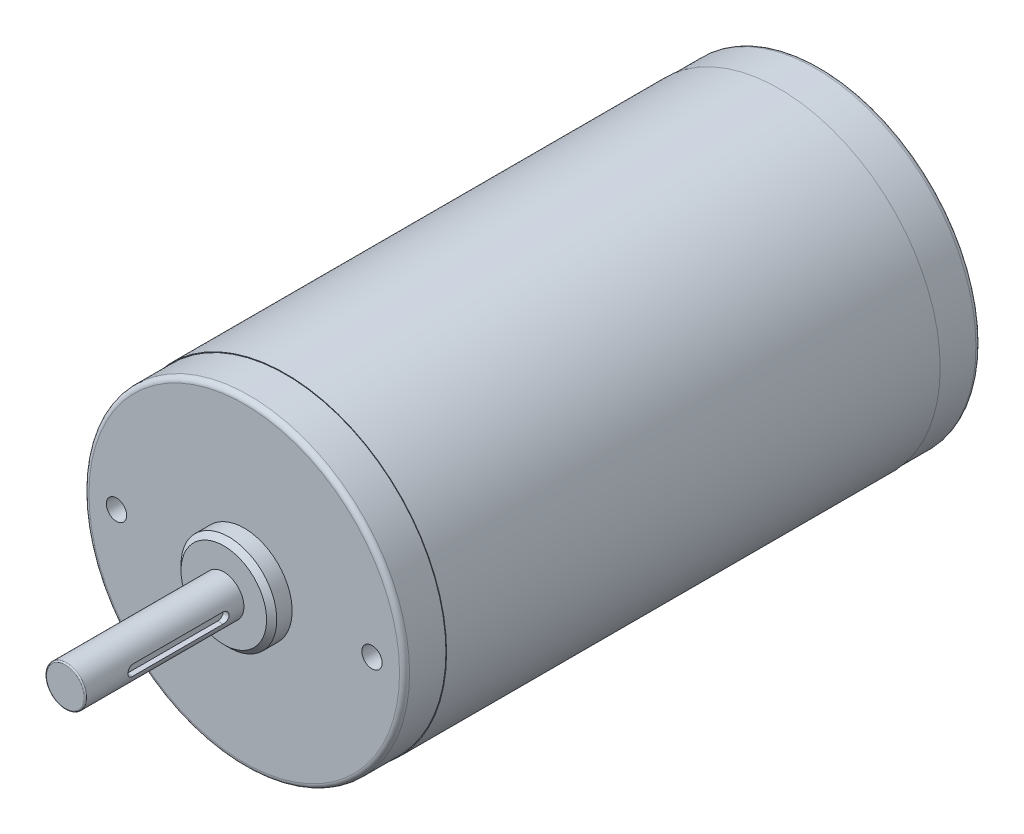
ISO-10303-21;
HEADER;
FILE_DESCRIPTION(('STEP AP214'),'2;1');
FILE_NAME('part.step','',(''),(''),'','','');
FILE_SCHEMA(('AUTOMOTIVE_DESIGN { 1 0 10303 214 1 1 1 1 }'));
ENDSEC;
DATA;
#1=APPLICATION_CONTEXT('core data for automotive mechanical design processes');
#2=APPLICATION_PROTOCOL_DEFINITION('international standard','automotive_design',2000,#1);
#3=PRODUCT_CONTEXT('',#1,'mechanical');
#4=PRODUCT('Part','Part','',(#3));
#5=PRODUCT_RELATED_PRODUCT_CATEGORY('part','',(#4));
#6=PRODUCT_DEFINITION_FORMATION('','',#4);
#7=PRODUCT_DEFINITION_CONTEXT('part definition',#1,'design');
#8=PRODUCT_DEFINITION('design','',#6,#7);
#9=PRODUCT_DEFINITION_SHAPE('','',#8);
#10=(LENGTH_UNIT() NAMED_UNIT(*) SI_UNIT(.MILLI.,.METRE.));
#11=(NAMED_UNIT(*) PLANE_ANGLE_UNIT() SI_UNIT($,.RADIAN.));
#12=(NAMED_UNIT(*) SI_UNIT($,.STERADIAN.) SOLID_ANGLE_UNIT());
#13=UNCERTAINTY_MEASURE_WITH_UNIT(LENGTH_MEASURE(1.E-05),#10,'distance_accuracy_value','');
#14=(GEOMETRIC_REPRESENTATION_CONTEXT(3) GLOBAL_UNCERTAINTY_ASSIGNED_CONTEXT((#13)) GLOBAL_UNIT_ASSIGNED_CONTEXT((#10,
#11,#12)) REPRESENTATION_CONTEXT('',''));
#15=CARTESIAN_POINT('',(0.,0.,0.));
#16=DIRECTION('',(0.,0.,1.));
#17=DIRECTION('',(1.,0.,0.));
#18=AXIS2_PLACEMENT_3D('',#15,#16,#17);
#19=CARTESIAN_POINT('',(35.56,109.2962,54.614));
#20=DIRECTION('',(0.,0.,1.));
#21=DIRECTION('',(1.,0.,0.));
#22=AXIS2_PLACEMENT_3D('',#19,#20,#21);
#23=PLANE('',#22);
#24=CARTESIAN_POINT('',(35.56,109.2962,54.614));
#25=DIRECTION('',(0.,0.,-1.));
#26=DIRECTION('',(-1.,0.,0.));
#27=AXIS2_PLACEMENT_3D('',#24,#25,#26);
#28=CIRCLE('',#27,3.74600000000008);
#29=CARTESIAN_POINT('',(31.8139999999999,109.2962,54.614));
#30=VERTEX_POINT('',#29);
#31=CARTESIAN_POINT('',(39.3060000000001,109.2962,54.614));
#32=VERTEX_POINT('',#31);
#33=EDGE_CURVE('E115',#30,#32,#28,.T.);
#34=ORIENTED_EDGE('',*,*,#33,.F.);
#35=CARTESIAN_POINT('',(35.56,109.2962,54.614));
#36=DIRECTION('',(0.,0.,-1.));
#37=DIRECTION('',(1.,0.,0.));
#38=AXIS2_PLACEMENT_3D('',#35,#36,#37);
#39=CIRCLE('',#38,3.74600000000008);
#40=EDGE_CURVE('E108',#32,#30,#39,.T.);
#41=ORIENTED_EDGE('',*,*,#40,.F.);
#42=EDGE_LOOP('',(#34,#41));
#43=FACE_BOUND('',#42,.T.);
#44=ADVANCED_FACE('F16',(#43),#23,.T.);
#45=CARTESIAN_POINT('',(38.3600000000001,109.2962,16.4984772078548));
#46=DIRECTION('',(1.,0.,0.));
#47=DIRECTION('',(0.,0.,-1.));
#48=AXIS2_PLACEMENT_3D('',#45,#46,#47);
#49=PLANE('',#48);
#50=DIRECTION('',(0.,0.,1.));
#51=VECTOR('',#50,1.);
#52=CARTESIAN_POINT('',(38.3600000000001,108.2462,16.4984772078548));
#53=LINE('',#52,#51);
#54=CARTESIAN_POINT('',(38.3600000000001,108.2462,27.1));
#55=VERTEX_POINT('',#54);
#56=CARTESIAN_POINT('',(38.3600000000001,108.2462,45.1));
#57=VERTEX_POINT('',#56);
#58=EDGE_CURVE('E103',#55,#57,#53,.T.);
#59=ORIENTED_EDGE('',*,*,#58,.F.);
#60=CARTESIAN_POINT('',(38.3600000000001,109.2962,27.1));
#61=DIRECTION('',(1.,0.,0.));
#62=DIRECTION('',(0.,0.,-1.));
#63=AXIS2_PLACEMENT_3D('',#60,#61,#62);
#64=CIRCLE('',#63,1.05);
#65=CARTESIAN_POINT('',(38.3600000000001,110.3462,27.1));
#66=VERTEX_POINT('',#65);
#67=EDGE_CURVE('E93',#55,#66,#64,.T.);
#68=ORIENTED_EDGE('',*,*,#67,.T.);
#69=DIRECTION('',(0.,0.,1.));
#70=VECTOR('',#69,1.);
#71=CARTESIAN_POINT('',(38.3600000000001,110.3462,16.4984772078548));
#72=LINE('',#71,#70);
#73=CARTESIAN_POINT('',(38.3600000000001,110.3462,45.1));
#74=VERTEX_POINT('',#73);
#75=EDGE_CURVE('E119',#66,#74,#72,.T.);
#76=ORIENTED_EDGE('',*,*,#75,.T.);
#77=CARTESIAN_POINT('',(38.3600000000001,109.2962,45.1));
#78=DIRECTION('',(-1.,0.,0.));
#79=DIRECTION('',(0.,0.,1.));
#80=AXIS2_PLACEMENT_3D('',#77,#78,#79);
#81=CIRCLE('',#80,1.05);
#82=EDGE_CURVE('E87',#74,#57,#81,.F.);
#83=ORIENTED_EDGE('',*,*,#82,.T.);
#84=EDGE_LOOP('',(#59,#68,#76,#83));
#85=FACE_BOUND('',#84,.T.);
#86=ADVANCED_FACE('F104',(#85),#49,.T.);
#87=CARTESIAN_POINT('',(38.3600000000001,108.2462,16.4984772078548));
#88=DIRECTION('',(0.,1.,0.));
#89=DIRECTION('',(0.,0.,1.));
#90=AXIS2_PLACEMENT_3D('',#87,#88,#89);
#91=PLANE('',#90);
#92=DIRECTION('',(0.,0.,-1.));
#93=VECTOR('',#92,1.);
#94=CARTESIAN_POINT('',(39.4197279696891,108.2462,54.614));
#95=LINE('',#94,#93);
#96=CARTESIAN_POINT('',(39.4197279696891,108.2462,27.1));
#97=VERTEX_POINT('',#96);
#98=CARTESIAN_POINT('',(39.4197279696891,108.2462,45.1));
#99=VERTEX_POINT('',#98);
#100=EDGE_CURVE('E112',#97,#99,#95,.F.);
#101=ORIENTED_EDGE('',*,*,#100,.F.);
#102=DIRECTION('',(1.,0.,0.));
#103=VECTOR('',#102,1.);
#104=CARTESIAN_POINT('',(38.3600000000001,108.2462,27.1));
#105=LINE('',#104,#103);
#106=EDGE_CURVE('E97',#97,#55,#105,.F.);
#107=ORIENTED_EDGE('',*,*,#106,.T.);
#108=ORIENTED_EDGE('',*,*,#58,.T.);
#109=DIRECTION('',(1.,0.,0.));
#110=VECTOR('',#109,1.);
#111=CARTESIAN_POINT('',(38.3600000000001,108.2462,45.1));
#112=LINE('',#111,#110);
#113=EDGE_CURVE('E113',#57,#99,#112,.T.);
#114=ORIENTED_EDGE('',*,*,#113,.T.);
#115=EDGE_LOOP('',(#101,#107,#108,#114));
#116=FACE_BOUND('',#115,.T.);
#117=ADVANCED_FACE('F110',(#116),#91,.T.);
#118=CARTESIAN_POINT('',(35.56,109.2962,54.36));
#119=DIRECTION('',(0.,0.,1.));
#120=DIRECTION('',(1.,0.,0.));
#121=AXIS2_PLACEMENT_3D('',#118,#119,#120);
#122=TOROIDAL_SURFACE('',#121,3.74600000000008,0.254);
#123=ORIENTED_EDGE('',*,*,#40,.T.);
#124=ORIENTED_EDGE('',*,*,#33,.T.);
#125=EDGE_LOOP('',(#123,#124));
#126=FACE_BOUND('',#125,.T.);
#127=CARTESIAN_POINT('',(35.56,109.2962,54.36));
#128=DIRECTION('',(0.,0.,-1.));
#129=DIRECTION('',(-1.,0.,0.));
#130=AXIS2_PLACEMENT_3D('',#127,#128,#129);
#131=CIRCLE('',#130,4.00000000000007);
#132=CARTESIAN_POINT('',(31.5599999999999,109.2962,54.36));
#133=VERTEX_POINT('',#132);
#134=EDGE_CURVE('E164',#133,#133,#131,.T.);
#135=ORIENTED_EDGE('',*,*,#134,.F.);
#136=EDGE_LOOP('',(#135));
#137=FACE_BOUND('',#136,.T.);
#138=ADVANCED_FACE('F146',(#126,#137),#122,.T.);
#139=CARTESIAN_POINT('',(38.3600000000001,109.2962,45.1));
#140=DIRECTION('',(-1.,0.,0.));
#141=DIRECTION('',(0.,0.,1.));
#142=AXIS2_PLACEMENT_3D('',#139,#140,#141);
#143=CYLINDRICAL_SURFACE('',#142,1.05);
#144=DIRECTION('',(1.,0.,0.));
#145=VECTOR('',#144,1.);
#146=CARTESIAN_POINT('',(38.3600000000001,110.3462,45.1));
#147=LINE('',#146,#145);
#148=CARTESIAN_POINT('',(39.4197279696891,110.3462,45.1));
#149=VERTEX_POINT('',#148);
#150=EDGE_CURVE('E101',#74,#149,#147,.T.);
#151=ORIENTED_EDGE('',*,*,#150,.T.);
#152=CARTESIAN_POINT('',(39.4197279696891,108.2462,45.1));
#153=CARTESIAN_POINT('',(39.4197258950768,108.24619958975,45.1289948990377));
#154=CARTESIAN_POINT('',(39.4200551064328,108.247401772744,45.1579753771942));
#155=CARTESIAN_POINT('',(39.4213547123988,108.252193790165,45.2157185717611));
#156=CARTESIAN_POINT('',(39.4223249908093,108.255783191888,45.2444813266804));
#157=CARTESIAN_POINT('',(39.4261578920524,108.270078067236,45.3300048839447));
#158=CARTESIAN_POINT('',(39.4299428342912,108.284310457697,45.3861763507014));
#159=CARTESIAN_POINT('',(39.4395286889104,108.321713164946,45.4952257963179));
#160=CARTESIAN_POINT('',(39.445329326456,108.344882263286,45.5481042230163));
#161=CARTESIAN_POINT('',(39.4582892232805,108.399469503916,45.6492511443793));
#162=CARTESIAN_POINT('',(39.4654488628844,108.430889956344,45.6975183428654));
#163=CARTESIAN_POINT('',(39.4805119710478,108.501890363002,45.7892077701155));
#164=CARTESIAN_POINT('',(39.4884281885094,108.541632256913,45.8325024671448));
#165=CARTESIAN_POINT('',(39.5040047400555,108.627813145963,45.9119068745175));
#166=CARTESIAN_POINT('',(39.5116649818293,108.67425452566,45.9480140156475));
#167=CARTESIAN_POINT('',(39.526010604883,108.773412379805,46.0125503896214));
#168=CARTESIAN_POINT('',(39.5326785635433,108.826216831296,46.040848518688));
#169=CARTESIAN_POINT('',(39.5441298010583,108.936002054238,46.0880888400132));
#170=CARTESIAN_POINT('',(39.5489153447307,108.992977708579,46.1070422822868));
#171=CARTESIAN_POINT('',(39.5549473168842,109.091228422711,46.1306241727345));
#172=CARTESIAN_POINT('',(39.5568321627736,109.13185376544,46.1378772746766));
#173=CARTESIAN_POINT('',(39.5593590428507,109.213713896391,46.147566034752));
#174=CARTESIAN_POINT('',(39.560001100914,109.254948672889,46.1500017854335));
#175=CARTESIAN_POINT('',(39.5599984549201,109.354094261643,46.1499974942296));
#176=CARTESIAN_POINT('',(39.5587300938834,109.412021122661,46.1451938276971));
#177=CARTESIAN_POINT('',(39.5537908073877,109.526225171743,46.1261319193829));
#178=CARTESIAN_POINT('',(39.5501176251492,109.582500758305,46.1118647965529));
#179=CARTESIAN_POINT('',(39.5407752151886,109.691711041936,46.0743710095572));
#180=CARTESIAN_POINT('',(39.5351088856793,109.744650458997,46.051157349786));
#181=CARTESIAN_POINT('',(39.5223803452478,109.845880148194,45.9964722913931));
#182=CARTESIAN_POINT('',(39.5153181479083,109.894170465564,45.9650009731229));
#183=CARTESIAN_POINT('',(39.5003832391547,109.985824414736,45.8939447079381));
#184=CARTESIAN_POINT('',(39.4924970081334,110.029068444468,45.8542083308329));
#185=CARTESIAN_POINT('',(39.4768899553604,110.108363690847,45.768070017791));
#186=CARTESIAN_POINT('',(39.4691691622905,110.144413669136,45.7216669366335));
#187=CARTESIAN_POINT('',(39.4546281048764,110.208880604601,45.6225587145474));
#188=CARTESIAN_POINT('',(39.447825217303,110.237158627992,45.5697605148942));
#189=CARTESIAN_POINT('',(39.4360941322255,110.284374941225,45.4599645484902));
#190=CARTESIAN_POINT('',(39.4311644713835,110.303320524877,45.4029701015121));
#191=CARTESIAN_POINT('',(39.424947536189,110.326869937927,45.3047298343336));
#192=CARTESIAN_POINT('',(39.4230031721686,110.334106552333,45.2641375466187));
#193=CARTESIAN_POINT('',(39.4203876966156,110.343775049367,45.1823710409093));
#194=CARTESIAN_POINT('',(39.419715789786,110.346209933161,45.141197202614));
#195=CARTESIAN_POINT('',(39.4197279696891,110.3462,45.1));
#196=B_SPLINE_CURVE_WITH_KNOTS('',3,(#152,#153,#154,#155,#156,#157,#158,#159,#160,#161,#162,
#163,#164,#165,#166,#167,#168,#169,#170,#171,#172,#173,#174,#175,#176,#177,#178,#179,#180,#181,
#182,#183,#184,#185,#186,#187,#188,#189,#190,#191,#192,#193,#194,#195),.UNSPECIFIED.,.F.,.F.,(4,
2,2,2,2,2,2,2,2,2,2,2,2,2,2,2,2,2,2,2,2,4),(0.,0.0869295778834422,0.17384340328612,
0.347151826879625,0.520436629596116,0.69376999881019,0.870856390838584,1.04800596970821,
1.22797015523126,1.40771715061754,1.53136439682193,1.65500926755904,1.82853892099362,
2.0022316554156,2.17567286221397,2.34911238140169,2.52606492372393,2.70304789975981,
2.88301467869373,3.0628405797152,3.18638852057382,3.3098592173462),.UNSPECIFIED.);
#197=EDGE_CURVE('E167',#99,#149,#196,.T.);
#198=ORIENTED_EDGE('',*,*,#197,.F.);
#199=ORIENTED_EDGE('',*,*,#113,.F.);
#200=ORIENTED_EDGE('',*,*,#82,.F.);
#201=EDGE_LOOP('',(#151,#198,#199,#200));
#202=FACE_BOUND('',#201,.T.);
#203=ADVANCED_FACE('F156',(#202),#143,.F.);
#204=CARTESIAN_POINT('',(38.3600000000001,110.3462,16.4984772078548));
#205=DIRECTION('',(0.,1.,0.));
#206=DIRECTION('',(0.,0.,1.));
#207=AXIS2_PLACEMENT_3D('',#204,#205,#206);
#208=PLANE('',#207);
#209=ORIENTED_EDGE('',*,*,#150,.F.);
#210=ORIENTED_EDGE('',*,*,#75,.F.);
#211=DIRECTION('',(1.,0.,0.));
#212=VECTOR('',#211,1.);
#213=CARTESIAN_POINT('',(38.3600000000001,110.3462,27.1));
#214=LINE('',#213,#212);
#215=CARTESIAN_POINT('',(39.4197279696891,110.3462,27.1));
#216=VERTEX_POINT('',#215);
#217=EDGE_CURVE('E99',#66,#216,#214,.T.);
#218=ORIENTED_EDGE('',*,*,#217,.T.);
#219=DIRECTION('',(0.,0.,-1.));
#220=VECTOR('',#219,1.);
#221=CARTESIAN_POINT('',(39.4197279696891,110.3462,54.614));
#222=LINE('',#221,#220);
#223=EDGE_CURVE('E169',#149,#216,#222,.T.);
#224=ORIENTED_EDGE('',*,*,#223,.F.);
#225=EDGE_LOOP('',(#209,#210,#218,#224));
#226=FACE_BOUND('',#225,.T.);
#227=ADVANCED_FACE('F417',(#226),#208,.F.);
#228=CARTESIAN_POINT('',(38.3600000000001,109.2962,27.1));
#229=DIRECTION('',(1.,0.,0.));
#230=DIRECTION('',(0.,0.,-1.));
#231=AXIS2_PLACEMENT_3D('',#228,#229,#230);
#232=CYLINDRICAL_SURFACE('',#231,1.05);
#233=ORIENTED_EDGE('',*,*,#67,.F.);
#234=ORIENTED_EDGE('',*,*,#106,.F.);
#235=CARTESIAN_POINT('',(39.4197279696891,110.3462,27.1));
#236=CARTESIAN_POINT('',(39.4197258950768,110.34620041025,27.0710051009623));
#237=CARTESIAN_POINT('',(39.4200551064329,110.344998227256,27.0420246228058));
#238=CARTESIAN_POINT('',(39.4213547123988,110.340206209835,26.9842814282389));
#239=CARTESIAN_POINT('',(39.4223249908093,110.336616808112,26.9555186733196));
#240=CARTESIAN_POINT('',(39.4261578920524,110.322321932764,26.8699951160553));
#241=CARTESIAN_POINT('',(39.4299428342912,110.308089542303,26.8138236492985));
#242=CARTESIAN_POINT('',(39.4395286889104,110.270686835054,26.7047742036821));
#243=CARTESIAN_POINT('',(39.445329326456,110.247517736714,26.6518957769836));
#244=CARTESIAN_POINT('',(39.4582892232805,110.192930496084,26.5507488556207));
#245=CARTESIAN_POINT('',(39.4654488628844,110.161510043656,26.5024816571346));
#246=CARTESIAN_POINT('',(39.4805119710478,110.090509636998,26.4107922298844));
#247=CARTESIAN_POINT('',(39.4884281885094,110.050767743087,26.3674975328551));
#248=CARTESIAN_POINT('',(39.5040047400555,109.964586854037,26.2880931254825));
#249=CARTESIAN_POINT('',(39.5116649818293,109.91814547434,26.2519859843525));
#250=CARTESIAN_POINT('',(39.526010604883,109.818987620195,26.1874496103786));
#251=CARTESIAN_POINT('',(39.5326785635433,109.766183168704,26.159151481312));
#252=CARTESIAN_POINT('',(39.5441298010583,109.656397945762,26.1119111599868));
#253=CARTESIAN_POINT('',(39.5489153447307,109.599422291421,26.0929577177131));
#254=CARTESIAN_POINT('',(39.5549473168842,109.501171577289,26.0693758272655));
#255=CARTESIAN_POINT('',(39.5568321627736,109.46054623456,26.0621227253234));
#256=CARTESIAN_POINT('',(39.5593590428507,109.378686103609,26.052433965248));
#257=CARTESIAN_POINT('',(39.560001100914,109.337451327111,26.0499982145665));
#258=CARTESIAN_POINT('',(39.5599984549201,109.238305738357,26.0500025057704));
#259=CARTESIAN_POINT('',(39.5587300938834,109.18037887734,26.0548061723029));
#260=CARTESIAN_POINT('',(39.5537908073877,109.066174828257,26.0738680806171));
#261=CARTESIAN_POINT('',(39.5501176251492,109.009899241695,26.0881352034471));
#262=CARTESIAN_POINT('',(39.5407752151886,108.900688958064,26.1256289904428));
#263=CARTESIAN_POINT('',(39.5351088856793,108.847749541003,26.148842650214));
#264=CARTESIAN_POINT('',(39.5223803452478,108.746519851806,26.2035277086069));
#265=CARTESIAN_POINT('',(39.5153181479083,108.698229534436,26.2349990268771));
#266=CARTESIAN_POINT('',(39.5003832391547,108.606575585264,26.3060552920619));
#267=CARTESIAN_POINT('',(39.4924970081334,108.563331555532,26.3457916691671));
#268=CARTESIAN_POINT('',(39.4768899553604,108.484036309153,26.431929982209));
#269=CARTESIAN_POINT('',(39.4691691622905,108.447986330864,26.4783330633665));
#270=CARTESIAN_POINT('',(39.4546281048764,108.383519395399,26.5774412854526));
#271=CARTESIAN_POINT('',(39.447825217303,108.355241372008,26.6302394851058));
#272=CARTESIAN_POINT('',(39.4360941322255,108.308025058775,26.7400354515098));
#273=CARTESIAN_POINT('',(39.4311644713835,108.289079475123,26.7970298984879));
#274=CARTESIAN_POINT('',(39.424947536189,108.265530062073,26.8952701656664));
#275=CARTESIAN_POINT('',(39.4230031721686,108.258293447667,26.9358624533813));
#276=CARTESIAN_POINT('',(39.4203876966156,108.248624950633,27.0176289590907));
#277=CARTESIAN_POINT('',(39.419715789786,108.246190066839,27.058802797386));
#278=CARTESIAN_POINT('',(39.4197279696891,108.2462,27.1));
#279=B_SPLINE_CURVE_WITH_KNOTS('',3,(#235,#236,#237,#238,#239,#240,#241,#242,#243,#244,#245,
#246,#247,#248,#249,#250,#251,#252,#253,#254,#255,#256,#257,#258,#259,#260,#261,#262,#263,#264,
#265,#266,#267,#268,#269,#270,#271,#272,#273,#274,#275,#276,#277,#278),.UNSPECIFIED.,.F.,.F.,(4,
2,2,2,2,2,2,2,2,2,2,2,2,2,2,2,2,2,2,2,2,4),(0.,0.0869295778834455,0.173843403286115,
0.347151826879623,0.520436629596136,0.693769998810197,0.870856390838592,1.0480059697082,
1.22797015523124,1.40771715061754,1.53136439682191,1.65500926755904,1.82853892099358,
2.00223165541559,2.17567286221396,2.34911238140168,2.52606492372391,2.7030478997598,
2.88301467869372,3.06284057971519,3.18638852057381,3.30985921734618),.UNSPECIFIED.);
#280=EDGE_CURVE('E172',#216,#97,#279,.T.);
#281=ORIENTED_EDGE('',*,*,#280,.F.);
#282=ORIENTED_EDGE('',*,*,#217,.F.);
#283=EDGE_LOOP('',(#233,#234,#281,#282));
#284=FACE_BOUND('',#283,.T.);
#285=ADVANCED_FACE('F94',(#284),#232,.F.);
#286=CARTESIAN_POINT('',(35.56,109.2962,54.614));
#287=DIRECTION('',(0.,0.,-1.));
#288=DIRECTION('',(-1.,0.,0.));
#289=AXIS2_PLACEMENT_3D('',#286,#287,#288);
#290=CYLINDRICAL_SURFACE('',#289,4.00000000000007);
#291=ORIENTED_EDGE('',*,*,#100,.T.);
#292=ORIENTED_EDGE('',*,*,#197,.T.);
#293=ORIENTED_EDGE('',*,*,#223,.T.);
#294=ORIENTED_EDGE('',*,*,#280,.T.);
#295=EDGE_LOOP('',(#291,#292,#293,#294));
#296=FACE_BOUND('',#295,.T.);
#297=CARTESIAN_POINT('',(35.56,109.2962,23.114));
#298=DIRECTION('',(0.,0.,-1.));
#299=DIRECTION('',(-1.,0.,0.));
#300=AXIS2_PLACEMENT_3D('',#297,#298,#299);
#301=CIRCLE('',#300,4.00000000000007);
#302=CARTESIAN_POINT('',(31.5599999999999,109.2962,23.114));
#303=VERTEX_POINT('',#302);
#304=EDGE_CURVE('E410',#303,#303,#301,.T.);
#305=ORIENTED_EDGE('',*,*,#304,.F.);
#306=EDGE_LOOP('',(#305));
#307=FACE_BOUND('',#306,.T.);
#308=ORIENTED_EDGE('',*,*,#134,.T.);
#309=EDGE_LOOP('',(#308));
#310=FACE_BOUND('',#309,.T.);
#311=ADVANCED_FACE('F255',(#296,#307,#310),#290,.T.);
#312=CARTESIAN_POINT('',(35.56,109.2962,23.114));
#313=DIRECTION('',(0.,0.,1.));
#314=DIRECTION('',(1.,0.,0.));
#315=AXIS2_PLACEMENT_3D('',#312,#313,#314);
#316=PLANE('',#315);
#317=ORIENTED_EDGE('',*,*,#304,.T.);
#318=EDGE_LOOP('',(#317));
#319=FACE_BOUND('',#318,.T.);
#320=CARTESIAN_POINT('',(35.56,109.2962,23.114));
#321=DIRECTION('',(0.,0.,-1.));
#322=DIRECTION('',(-1.,0.,0.));
#323=AXIS2_PLACEMENT_3D('',#320,#321,#322);
#324=CIRCLE('',#323,8.50900000182337);
#325=CARTESIAN_POINT('',(27.0509999981766,109.2962,23.114));
#326=VERTEX_POINT('',#325);
#327=EDGE_CURVE('E408',#326,#326,#324,.T.);
#328=ORIENTED_EDGE('',*,*,#327,.F.);
#329=EDGE_LOOP('',(#328));
#330=FACE_BOUND('',#329,.T.);
#331=ADVANCED_FACE('F251',(#319,#330),#316,.T.);
#332=CARTESIAN_POINT('',(48.8853596371201,127.903290682857,-97.8026999980236));
#333=DIRECTION('',(0.,0.,-1.));
#334=DIRECTION('',(-1.,0.,0.));
#335=AXIS2_PLACEMENT_3D('',#332,#333,#334);
#336=PLANE('',#335);
#337=CARTESIAN_POINT('',(46.76735963712,127.903290682857,-97.8026999979988));
#338=DIRECTION('',(0.,0.,1.));
#339=DIRECTION('',(0.,-1.,0.));
#340=AXIS2_PLACEMENT_3D('',#337,#338,#339);
#341=CIRCLE('',#340,2.11800000003411);
#342=CARTESIAN_POINT('',(46.76735963712,125.785290682823,-97.8026999979988));
#343=VERTEX_POINT('',#342);
#344=EDGE_CURVE('E405',#343,#343,#341,.T.);
#345=ORIENTED_EDGE('',*,*,#344,.F.);
#346=EDGE_LOOP('',(#345));
#347=FACE_BOUND('',#346,.T.);
#348=ADVANCED_FACE('F247',(#347),#336,.T.);
#349=CARTESIAN_POINT('',(56.2850906808811,120.503559639096,-97.8026999980238));
#350=DIRECTION('',(0.,0.,-1.));
#351=DIRECTION('',(-1.,0.,0.));
#352=AXIS2_PLACEMENT_3D('',#349,#350,#351);
#353=PLANE('',#352);
#354=CARTESIAN_POINT('',(54.1670906808811,120.503559639096,-97.8026999980557));
#355=DIRECTION('',(0.,0.,1.));
#356=DIRECTION('',(0.,-1.,0.));
#357=AXIS2_PLACEMENT_3D('',#354,#355,#356);
#358=CIRCLE('',#357,2.11799999994966);
#359=CARTESIAN_POINT('',(54.1670906808811,118.385559639146,-97.8026999980557));
#360=VERTEX_POINT('',#359);
#361=EDGE_CURVE('E401',#360,#360,#358,.T.);
#362=ORIENTED_EDGE('',*,*,#361,.F.);
#363=EDGE_LOOP('',(#362));
#364=FACE_BOUND('',#363,.T.);
#365=ADVANCED_FACE('F235',(#364),#353,.T.);
#366=CARTESIAN_POINT('',(35.56,109.2962,-100.317299999998));
#367=DIRECTION('',(0.,0.,-1.));
#368=DIRECTION('',(-1.,0.,0.));
#369=AXIS2_PLACEMENT_3D('',#366,#367,#368);
#370=PLANE('',#369);
#371=CARTESIAN_POINT('',(35.56,109.2962,-100.317299999998));
#372=DIRECTION('',(0.,0.,1.));
#373=DIRECTION('',(1.,0.,0.));
#374=AXIS2_PLACEMENT_3D('',#371,#372,#373);
#375=CIRCLE('',#374,14.0368000000003);
#376=CARTESIAN_POINT('',(49.5968000000003,109.2962,-100.317299999998));
#377=VERTEX_POINT('',#376);
#378=CARTESIAN_POINT('',(21.5231999999997,109.2962,-100.317299999998));
#379=VERTEX_POINT('',#378);
#380=EDGE_CURVE('E216',#377,#379,#375,.T.);
#381=ORIENTED_EDGE('',*,*,#380,.F.);
#382=CARTESIAN_POINT('',(35.56,109.2962,-100.317299999998));
#383=DIRECTION('',(0.,0.,1.));
#384=DIRECTION('',(-1.,0.,0.));
#385=AXIS2_PLACEMENT_3D('',#382,#383,#384);
#386=CIRCLE('',#385,14.0368000000003);
#387=EDGE_CURVE('E404',#379,#377,#386,.T.);
#388=ORIENTED_EDGE('',*,*,#387,.F.);
#389=EDGE_LOOP('',(#381,#388));
#390=FACE_BOUND('',#389,.T.);
#391=ADVANCED_FACE('F224',(#390),#370,.T.);
#392=CARTESIAN_POINT('',(10.1599999999994,109.2962,5.43560000011212));
#393=DIRECTION('',(0.,0.,1.));
#394=DIRECTION('',(1.,0.,0.));
#395=AXIS2_PLACEMENT_3D('',#392,#393,#394);
#396=CONICAL_SURFACE('',#395,2.01930000012817,1.02974425747654);
#397=CARTESIAN_POINT('',(10.1600000000133,109.2962,4.22228214875986));
#398=VERTEX_POINT('',#397);
#399=VERTEX_LOOP('',#398);
#400=FACE_BOUND('',#399,.T.);
#401=CARTESIAN_POINT('',(10.1599999999994,109.2962,5.4356000000007));
#402=DIRECTION('',(0.,0.,1.));
#403=DIRECTION('',(1.,0.,0.));
#404=AXIS2_PLACEMENT_3D('',#401,#402,#403);
#405=CIRCLE('',#404,2.01930000000003);
#406=CARTESIAN_POINT('',(12.1792999999994,109.2962,5.4356000000007));
#407=VERTEX_POINT('',#406);
#408=EDGE_CURVE('E213',#407,#407,#405,.T.);
#409=ORIENTED_EDGE('',*,*,#408,.T.);
#410=EDGE_LOOP('',(#409));
#411=FACE_BOUND('',#410,.T.);
#412=ADVANCED_FACE('F234',(#400,#411),#396,.F.);
#413=CARTESIAN_POINT('',(60.96,109.2962,5.43559999994159));
#414=DIRECTION('',(0.,0.,1.));
#415=DIRECTION('',(1.,0.,0.));
#416=AXIS2_PLACEMENT_3D('',#413,#414,#415);
#417=CONICAL_SURFACE('',#416,2.01929999988128,1.02974425744088);
#418=CARTESIAN_POINT('',(60.9599999998807,109.2962,4.22228214875986));
#419=VERTEX_POINT('',#418);
#420=VERTEX_LOOP('',#419);
#421=FACE_BOUND('',#420,.T.);
#422=CARTESIAN_POINT('',(60.96,109.2962,5.43560000000074));
#423=DIRECTION('',(0.,0.,1.));
#424=DIRECTION('',(1.,0.,0.));
#425=AXIS2_PLACEMENT_3D('',#422,#423,#424);
#426=CIRCLE('',#425,2.01930000000003);
#427=CARTESIAN_POINT('',(62.9793,109.2962,5.43560000000074));
#428=VERTEX_POINT('',#427);
#429=EDGE_CURVE('E210',#428,#428,#426,.T.);
#430=ORIENTED_EDGE('',*,*,#429,.T.);
#431=EDGE_LOOP('',(#430));
#432=FACE_BOUND('',#431,.T.);
#433=ADVANCED_FACE('F574',(#421,#432),#417,.F.);
#434=CARTESIAN_POINT('',(35.56,109.2962,22.0979999999996));
#435=DIRECTION('',(0.,0.,-1.));
#436=DIRECTION('',(-1.,0.,0.));
#437=AXIS2_PLACEMENT_3D('',#434,#435,#436);
#438=CONICAL_SURFACE('',#437,9.52500000000019,0.785398162500005);
#439=CARTESIAN_POINT('',(35.56,109.2962,22.0979999999996));
#440=DIRECTION('',(0.,0.,-1.));
#441=DIRECTION('',(-1.,0.,0.));
#442=AXIS2_PLACEMENT_3D('',#439,#440,#441);
#443=CIRCLE('',#442,9.52500000000019);
#444=CARTESIAN_POINT('',(26.0349999999998,109.2962,22.0979999999996));
#445=VERTEX_POINT('',#444);
#446=EDGE_CURVE('E207',#445,#445,#443,.T.);
#447=ORIENTED_EDGE('',*,*,#446,.F.);
#448=EDGE_LOOP('',(#447));
#449=FACE_BOUND('',#448,.T.);
#450=ORIENTED_EDGE('',*,*,#327,.T.);
#451=EDGE_LOOP('',(#450));
#452=FACE_BOUND('',#451,.T.);
#453=ADVANCED_FACE('F567',(#449,#452),#438,.T.);
#454=CARTESIAN_POINT('',(46.76735963712,127.903290682857,-95.6026999959931));
#455=DIRECTION('',(0.,0.,1.));
#456=DIRECTION('',(0.,-1.,0.));
#457=AXIS2_PLACEMENT_3D('',#454,#455,#456);
#458=CONICAL_SURFACE('',#457,4.31800000198298,0.785398163384529);
#459=CARTESIAN_POINT('',(46.76735963712,127.903290682857,-95.6026999960491));
#460=DIRECTION('',(0.,0.,1.));
#461=DIRECTION('',(1.,0.,0.));
#462=AXIS2_PLACEMENT_3D('',#459,#460,#461);
#463=CIRCLE('',#462,4.3180000019745);
#464=CARTESIAN_POINT('',(51.0853596390945,127.903290682857,-95.6026999960491));
#465=VERTEX_POINT('',#464);
#466=EDGE_CURVE('E204',#465,#465,#463,.T.);
#467=ORIENTED_EDGE('',*,*,#466,.F.);
#468=EDGE_LOOP('',(#467));
#469=FACE_BOUND('',#468,.T.);
#470=ORIENTED_EDGE('',*,*,#344,.T.);
#471=EDGE_LOOP('',(#470));
#472=FACE_BOUND('',#471,.T.);
#473=ADVANCED_FACE('F573',(#469,#472),#458,.T.);
#474=CARTESIAN_POINT('',(54.1670906808811,120.503559639096,-95.6026999961637));
#475=DIRECTION('',(0.,0.,1.));
#476=DIRECTION('',(0.,-1.,0.));
#477=AXIS2_PLACEMENT_3D('',#474,#475,#476);
#478=CONICAL_SURFACE('',#477,4.31800000184168,0.785398163397448);
#479=CARTESIAN_POINT('',(54.1670906808811,120.503559639096,-95.6026999960494));
#480=DIRECTION('',(0.,0.,1.));
#481=DIRECTION('',(1.,0.,0.));
#482=AXIS2_PLACEMENT_3D('',#479,#480,#481);
#483=CIRCLE('',#482,4.31800000197446);
#484=CARTESIAN_POINT('',(58.4850906828556,120.503559639096,-95.6026999960494));
#485=VERTEX_POINT('',#484);
#486=EDGE_CURVE('E201',#485,#485,#483,.T.);
#487=ORIENTED_EDGE('',*,*,#486,.F.);
#488=EDGE_LOOP('',(#487));
#489=FACE_BOUND('',#488,.T.);
#490=ORIENTED_EDGE('',*,*,#361,.T.);
#491=EDGE_LOOP('',(#490));
#492=FACE_BOUND('',#491,.T.);
#493=ADVANCED_FACE('F191',(#489,#492),#478,.T.);
#494=CARTESIAN_POINT('',(35.56,109.2962,-99.317299999998));
#495=DIRECTION('',(0.,0.,-1.));
#496=DIRECTION('',(-1.,0.,0.));
#497=AXIS2_PLACEMENT_3D('',#494,#495,#496);
#498=TOROIDAL_SURFACE('',#497,14.0368000000003,1.);
#499=ORIENTED_EDGE('',*,*,#387,.T.);
#500=ORIENTED_EDGE('',*,*,#380,.T.);
#501=EDGE_LOOP('',(#499,#500));
#502=FACE_BOUND('',#501,.T.);
#503=CARTESIAN_POINT('',(35.56,109.2962,-99.317299999998));
#504=DIRECTION('',(0.,0.,1.));
#505=DIRECTION('',(1.,0.,0.));
#506=AXIS2_PLACEMENT_3D('',#503,#504,#505);
#507=CIRCLE('',#506,15.0368000000003);
#508=CARTESIAN_POINT('',(50.5968000000003,109.2962,-99.317299999998));
#509=VERTEX_POINT('',#508);
#510=EDGE_CURVE('E199',#509,#509,#507,.T.);
#511=ORIENTED_EDGE('',*,*,#510,.F.);
#512=EDGE_LOOP('',(#511));
#513=FACE_BOUND('',#512,.T.);
#514=ADVANCED_FACE('F179',(#502,#513),#498,.T.);
#515=CARTESIAN_POINT('',(10.1599999999994,109.2962,19.05));
#516=DIRECTION('',(0.,0.,1.));
#517=DIRECTION('',(1.,0.,0.));
#518=AXIS2_PLACEMENT_3D('',#515,#516,#517);
#519=CYLINDRICAL_SURFACE('',#518,2.01930000000003);
#520=CARTESIAN_POINT('',(10.1599999999994,109.2962,19.05));
#521=DIRECTION('',(0.,0.,1.));
#522=DIRECTION('',(1.,0.,0.));
#523=AXIS2_PLACEMENT_3D('',#520,#521,#522);
#524=CIRCLE('',#523,2.01930000000003);
#525=CARTESIAN_POINT('',(12.1792999999994,109.2962,19.05));
#526=VERTEX_POINT('',#525);
#527=EDGE_CURVE('E398',#526,#526,#524,.F.);
#528=ORIENTED_EDGE('',*,*,#527,.F.);
#529=EDGE_LOOP('',(#528));
#530=FACE_BOUND('',#529,.T.);
#531=ORIENTED_EDGE('',*,*,#408,.F.);
#532=EDGE_LOOP('',(#531));
#533=FACE_BOUND('',#532,.T.);
#534=ADVANCED_FACE('F190',(#530,#533),#519,.F.);
#535=CARTESIAN_POINT('',(60.96,109.2962,19.05));
#536=DIRECTION('',(0.,0.,1.));
#537=DIRECTION('',(1.,0.,0.));
#538=AXIS2_PLACEMENT_3D('',#535,#536,#537);
#539=CYLINDRICAL_SURFACE('',#538,2.01930000000003);
#540=CARTESIAN_POINT('',(60.96,109.2962,19.05));
#541=DIRECTION('',(0.,0.,1.));
#542=DIRECTION('',(1.,0.,0.));
#543=AXIS2_PLACEMENT_3D('',#540,#541,#542);
#544=CIRCLE('',#543,2.01930000000003);
#545=CARTESIAN_POINT('',(62.9793,109.2962,19.05));
#546=VERTEX_POINT('',#545);
#547=EDGE_CURVE('E395',#546,#546,#544,.F.);
#548=ORIENTED_EDGE('',*,*,#547,.F.);
#549=EDGE_LOOP('',(#548));
#550=FACE_BOUND('',#549,.T.);
#551=ORIENTED_EDGE('',*,*,#429,.F.);
#552=EDGE_LOOP('',(#551));
#553=FACE_BOUND('',#552,.T.);
#554=ADVANCED_FACE('F596',(#550,#553),#539,.F.);
#555=CARTESIAN_POINT('',(35.56,109.2962,23.114));
#556=DIRECTION('',(0.,0.,-1.));
#557=DIRECTION('',(-1.,0.,0.));
#558=AXIS2_PLACEMENT_3D('',#555,#556,#557);
#559=CYLINDRICAL_SURFACE('',#558,9.52500000000019);
#560=CARTESIAN_POINT('',(35.56,109.2962,19.05));
#561=DIRECTION('',(0.,0.,-1.));
#562=DIRECTION('',(-1.,0.,0.));
#563=AXIS2_PLACEMENT_3D('',#560,#561,#562);
#564=CIRCLE('',#563,9.52500000000019);
#565=CARTESIAN_POINT('',(26.0349999999998,109.2962,19.05));
#566=VERTEX_POINT('',#565);
#567=EDGE_CURVE('E392',#566,#566,#564,.T.);
#568=ORIENTED_EDGE('',*,*,#567,.F.);
#569=EDGE_LOOP('',(#568));
#570=FACE_BOUND('',#569,.T.);
#571=ORIENTED_EDGE('',*,*,#446,.T.);
#572=EDGE_LOOP('',(#571));
#573=FACE_BOUND('',#572,.T.);
#574=ADVANCED_FACE('F606',(#570,#573),#559,.T.);
#575=CARTESIAN_POINT('',(46.76735963712,127.903290682857,-97.8026999980236));
#576=DIRECTION('',(0.,0.,1.));
#577=DIRECTION('',(1.,0.,0.));
#578=AXIS2_PLACEMENT_3D('',#575,#576,#577);
#579=CYLINDRICAL_SURFACE('',#578,4.3180000019745);
#580=CARTESIAN_POINT('',(46.76735963712,127.903290682857,-95.554799999998));
#581=DIRECTION('',(0.,0.,1.));
#582=DIRECTION('',(1.,0.,0.));
#583=AXIS2_PLACEMENT_3D('',#580,#581,#582);
#584=CIRCLE('',#583,4.3180000019745);
#585=CARTESIAN_POINT('',(51.0853596390945,127.903290682857,-95.554799999998));
#586=VERTEX_POINT('',#585);
#587=EDGE_CURVE('E384',#586,#586,#584,.T.);
#588=ORIENTED_EDGE('',*,*,#587,.F.);
#589=EDGE_LOOP('',(#588));
#590=FACE_BOUND('',#589,.T.);
#591=ORIENTED_EDGE('',*,*,#466,.T.);
#592=EDGE_LOOP('',(#591));
#593=FACE_BOUND('',#592,.T.);
#594=ADVANCED_FACE('F616',(#590,#593),#579,.T.);
#595=CARTESIAN_POINT('',(54.1670906808811,120.503559639096,-97.8026999980238));
#596=DIRECTION('',(0.,0.,1.));
#597=DIRECTION('',(1.,0.,0.));
#598=AXIS2_PLACEMENT_3D('',#595,#596,#597);
#599=CYLINDRICAL_SURFACE('',#598,4.31800000197446);
#600=CARTESIAN_POINT('',(54.1670906808811,120.503559639096,-95.554799999998));
#601=DIRECTION('',(0.,0.,1.));
#602=DIRECTION('',(1.,0.,0.));
#603=AXIS2_PLACEMENT_3D('',#600,#601,#602);
#604=CIRCLE('',#603,4.31800000197446);
#605=CARTESIAN_POINT('',(58.4850906828556,120.503559639096,-95.554799999998));
#606=VERTEX_POINT('',#605);
#607=EDGE_CURVE('E380',#606,#606,#604,.T.);
#608=ORIENTED_EDGE('',*,*,#607,.F.);
#609=EDGE_LOOP('',(#608));
#610=FACE_BOUND('',#609,.T.);
#611=ORIENTED_EDGE('',*,*,#486,.T.);
#612=EDGE_LOOP('',(#611));
#613=FACE_BOUND('',#612,.T.);
#614=ADVANCED_FACE('F630',(#610,#613),#599,.T.);
#615=CARTESIAN_POINT('',(35.56,109.2962,-100.317299999998));
#616=DIRECTION('',(0.,0.,1.));
#617=DIRECTION('',(1.,0.,0.));
#618=AXIS2_PLACEMENT_3D('',#615,#616,#617);
#619=CYLINDRICAL_SURFACE('',#618,15.0368000000003);
#620=CARTESIAN_POINT('',(35.56,109.2962,-95.554799999998));
#621=DIRECTION('',(0.,0.,1.));
#622=DIRECTION('',(1.,0.,0.));
#623=AXIS2_PLACEMENT_3D('',#620,#621,#622);
#624=CIRCLE('',#623,15.0368000000003);
#625=CARTESIAN_POINT('',(50.5968000000003,109.2962,-95.554799999998));
#626=VERTEX_POINT('',#625);
#627=EDGE_CURVE('E378',#626,#626,#624,.T.);
#628=ORIENTED_EDGE('',*,*,#627,.F.);
#629=EDGE_LOOP('',(#628));
#630=FACE_BOUND('',#629,.T.);
#631=ORIENTED_EDGE('',*,*,#510,.T.);
#632=EDGE_LOOP('',(#631));
#633=FACE_BOUND('',#632,.T.);
#634=ADVANCED_FACE('F624',(#630,#633),#619,.T.);
#635=CARTESIAN_POINT('',(35.56,109.2962,19.05));
#636=DIRECTION('',(0.,0.,1.));
#637=DIRECTION('',(1.,0.,0.));
#638=AXIS2_PLACEMENT_3D('',#635,#636,#637);
#639=PLANE('',#638);
#640=ORIENTED_EDGE('',*,*,#567,.T.);
#641=EDGE_LOOP('',(#640));
#642=FACE_BOUND('',#641,.T.);
#643=ORIENTED_EDGE('',*,*,#547,.T.);
#644=EDGE_LOOP('',(#643));
#645=FACE_BOUND('',#644,.T.);
#646=ORIENTED_EDGE('',*,*,#527,.T.);
#647=EDGE_LOOP('',(#646));
#648=FACE_BOUND('',#647,.T.);
#649=CARTESIAN_POINT('',(35.56,109.2962,19.05));
#650=DIRECTION('',(0.,0.,-1.));
#651=DIRECTION('',(-1.,0.,0.));
#652=AXIS2_PLACEMENT_3D('',#649,#650,#651);
#653=CIRCLE('',#652,30.8770000000005);
#654=CARTESIAN_POINT('',(4.6829999999995,109.2962,19.05));
#655=VERTEX_POINT('',#654);
#656=CARTESIAN_POINT('',(66.4370000000005,109.2962,19.05));
#657=VERTEX_POINT('',#656);
#658=EDGE_CURVE('E350',#655,#657,#653,.T.);
#659=ORIENTED_EDGE('',*,*,#658,.F.);
#660=CARTESIAN_POINT('',(35.56,109.2962,19.05));
#661=DIRECTION('',(0.,0.,-1.));
#662=DIRECTION('',(1.,0.,0.));
#663=AXIS2_PLACEMENT_3D('',#660,#661,#662);
#664=CIRCLE('',#663,30.8770000000005);
#665=EDGE_CURVE('E360',#657,#655,#664,.T.);
#666=ORIENTED_EDGE('',*,*,#665,.F.);
#667=EDGE_LOOP('',(#659,#666));
#668=FACE_BOUND('',#667,.T.);
#669=ADVANCED_FACE('F325',(#642,#645,#648,#668),#639,.T.);
#670=CARTESIAN_POINT('',(35.56,109.2962,-95.554799999998));
#671=DIRECTION('',(0.,0.,-1.));
#672=DIRECTION('',(-1.,0.,0.));
#673=AXIS2_PLACEMENT_3D('',#670,#671,#672);
#674=PLANE('',#673);
#675=ORIENTED_EDGE('',*,*,#627,.T.);
#676=EDGE_LOOP('',(#675));
#677=FACE_BOUND('',#676,.T.);
#678=ORIENTED_EDGE('',*,*,#607,.T.);
#679=EDGE_LOOP('',(#678));
#680=FACE_BOUND('',#679,.T.);
#681=ORIENTED_EDGE('',*,*,#587,.T.);
#682=EDGE_LOOP('',(#681));
#683=FACE_BOUND('',#682,.T.);
#684=CARTESIAN_POINT('',(35.56,109.2962,-95.554799999998));
#685=DIRECTION('',(0.,0.,1.));
#686=DIRECTION('',(1.,0.,0.));
#687=AXIS2_PLACEMENT_3D('',#684,#685,#686);
#688=CIRCLE('',#687,30.8770000000005);
#689=CARTESIAN_POINT('',(66.4370000000005,109.2962,-95.554799999998));
#690=VERTEX_POINT('',#689);
#691=CARTESIAN_POINT('',(4.6829999999995,109.2962,-95.554799999998));
#692=VERTEX_POINT('',#691);
#693=EDGE_CURVE('E309',#690,#692,#688,.T.);
#694=ORIENTED_EDGE('',*,*,#693,.F.);
#695=CARTESIAN_POINT('',(35.56,109.2962,-95.554799999998));
#696=DIRECTION('',(0.,0.,1.));
#697=DIRECTION('',(-1.,0.,0.));
#698=AXIS2_PLACEMENT_3D('',#695,#696,#697);
#699=CIRCLE('',#698,30.8770000000005);
#700=EDGE_CURVE('E36',#692,#690,#699,.T.);
#701=ORIENTED_EDGE('',*,*,#700,.F.);
#702=EDGE_LOOP('',(#694,#701));
#703=FACE_BOUND('',#702,.T.);
#704=ADVANCED_FACE('F316',(#677,#680,#683,#703),#674,.T.);
#705=CARTESIAN_POINT('',(35.56,109.2962,18.05));
#706=DIRECTION('',(0.,0.,1.));
#707=DIRECTION('',(1.,0.,0.));
#708=AXIS2_PLACEMENT_3D('',#705,#706,#707);
#709=TOROIDAL_SURFACE('',#708,30.8770000000005,1.);
#710=ORIENTED_EDGE('',*,*,#665,.T.);
#711=ORIENTED_EDGE('',*,*,#658,.T.);
#712=EDGE_LOOP('',(#710,#711));
#713=FACE_BOUND('',#712,.T.);
#714=CARTESIAN_POINT('',(35.56,109.2962,18.05));
#715=DIRECTION('',(0.,0.,-1.));
#716=DIRECTION('',(-1.,0.,0.));
#717=AXIS2_PLACEMENT_3D('',#714,#715,#716);
#718=CIRCLE('',#717,31.8770000000005);
#719=CARTESIAN_POINT('',(3.6829999999995,109.2962,18.05));
#720=VERTEX_POINT('',#719);
#721=EDGE_CURVE('E307',#720,#720,#718,.T.);
#722=ORIENTED_EDGE('',*,*,#721,.F.);
#723=EDGE_LOOP('',(#722));
#724=FACE_BOUND('',#723,.T.);
#725=ADVANCED_FACE('F296',(#713,#724),#709,.T.);
#726=CARTESIAN_POINT('',(35.56,109.2962,-94.554799999998));
#727=DIRECTION('',(0.,0.,-1.));
#728=DIRECTION('',(-1.,0.,0.));
#729=AXIS2_PLACEMENT_3D('',#726,#727,#728);
#730=TOROIDAL_SURFACE('',#729,30.8770000000005,1.);
#731=ORIENTED_EDGE('',*,*,#700,.T.);
#732=ORIENTED_EDGE('',*,*,#693,.T.);
#733=EDGE_LOOP('',(#731,#732));
#734=FACE_BOUND('',#733,.T.);
#735=CARTESIAN_POINT('',(35.56,109.2962,-94.554799999998));
#736=DIRECTION('',(0.,0.,1.));
#737=DIRECTION('',(1.,0.,0.));
#738=AXIS2_PLACEMENT_3D('',#735,#736,#737);
#739=CIRCLE('',#738,31.8770000000005);
#740=CARTESIAN_POINT('',(67.4370000000005,109.2962,-94.554799999998));
#741=VERTEX_POINT('',#740);
#742=EDGE_CURVE('E306',#741,#741,#739,.T.);
#743=ORIENTED_EDGE('',*,*,#742,.F.);
#744=EDGE_LOOP('',(#743));
#745=FACE_BOUND('',#744,.T.);
#746=ADVANCED_FACE('F284',(#734,#745),#730,.T.);
#747=CARTESIAN_POINT('',(35.56,109.2962,19.05));
#748=DIRECTION('',(0.,0.,-1.));
#749=DIRECTION('',(-1.,0.,0.));
#750=AXIS2_PLACEMENT_3D('',#747,#748,#749);
#751=CYLINDRICAL_SURFACE('',#750,31.8770000000005);
#752=CARTESIAN_POINT('',(35.56,109.2962,10.8204000000007));
#753=DIRECTION('',(0.,0.,-1.));
#754=DIRECTION('',(-1.,0.,0.));
#755=AXIS2_PLACEMENT_3D('',#752,#753,#754);
#756=CIRCLE('',#755,31.8770000000005);
#757=CARTESIAN_POINT('',(3.6829999999995,109.2962,10.8204000000007));
#758=VERTEX_POINT('',#757);
#759=EDGE_CURVE('E387',#758,#758,#756,.T.);
#760=ORIENTED_EDGE('',*,*,#759,.F.);
#761=EDGE_LOOP('',(#760));
#762=FACE_BOUND('',#761,.T.);
#763=ORIENTED_EDGE('',*,*,#721,.T.);
#764=EDGE_LOOP('',(#763));
#765=FACE_BOUND('',#764,.T.);
#766=ADVANCED_FACE('F295',(#762,#765),#751,.T.);
#767=CARTESIAN_POINT('',(35.56,109.2962,-95.554799999998));
#768=DIRECTION('',(0.,0.,1.));
#769=DIRECTION('',(1.,0.,0.));
#770=AXIS2_PLACEMENT_3D('',#767,#768,#769);
#771=CYLINDRICAL_SURFACE('',#770,31.8770000000005);
#772=CARTESIAN_POINT('',(35.56,109.2962,-87.325199999998));
#773=DIRECTION('',(0.,0.,1.));
#774=DIRECTION('',(1.,0.,0.));
#775=AXIS2_PLACEMENT_3D('',#772,#773,#774);
#776=CIRCLE('',#775,31.8770000000005);
#777=CARTESIAN_POINT('',(67.4370000000005,109.2962,-87.325199999998));
#778=VERTEX_POINT('',#777);
#779=EDGE_CURVE('E449',#778,#778,#776,.T.);
#780=ORIENTED_EDGE('',*,*,#779,.F.);
#781=EDGE_LOOP('',(#780));
#782=FACE_BOUND('',#781,.T.);
#783=ORIENTED_EDGE('',*,*,#742,.T.);
#784=EDGE_LOOP('',(#783));
#785=FACE_BOUND('',#784,.T.);
#786=ADVANCED_FACE('F438',(#782,#785),#771,.T.);
#787=CARTESIAN_POINT('',(67.5640000000005,109.2962,10.8204000000007));
#788=DIRECTION('',(0.,0.,1.));
#789=DIRECTION('',(1.,0.,0.));
#790=AXIS2_PLACEMENT_3D('',#787,#788,#789);
#791=PLANE('',#790);
#792=ORIENTED_EDGE('',*,*,#759,.T.);
#793=EDGE_LOOP('',(#792));
#794=FACE_BOUND('',#793,.T.);
#795=CARTESIAN_POINT('',(35.56,109.2962,10.8204000000007));
#796=DIRECTION('',(0.,0.,-1.));
#797=DIRECTION('',(-1.,0.,0.));
#798=AXIS2_PLACEMENT_3D('',#795,#796,#797);
#799=CIRCLE('',#798,32.0040000000005);
#800=CARTESIAN_POINT('',(3.5559999999995,109.2962,10.8204000000007));
#801=VERTEX_POINT('',#800);
#802=EDGE_CURVE('E28',#801,#801,#799,.T.);
#803=ORIENTED_EDGE('',*,*,#802,.F.);
#804=EDGE_LOOP('',(#803));
#805=FACE_BOUND('',#804,.T.);
#806=ADVANCED_FACE('F432',(#794,#805),#791,.T.);
#807=CARTESIAN_POINT('',(35.56,109.2962,-87.325199999998));
#808=DIRECTION('',(0.,0.,-1.));
#809=DIRECTION('',(-1.,0.,0.));
#810=AXIS2_PLACEMENT_3D('',#807,#808,#809);
#811=PLANE('',#810);
#812=ORIENTED_EDGE('',*,*,#779,.T.);
#813=EDGE_LOOP('',(#812));
#814=FACE_BOUND('',#813,.T.);
#815=CARTESIAN_POINT('',(35.56,109.2962,-87.325199999998));
#816=DIRECTION('',(0.,0.,-1.));
#817=DIRECTION('',(-1.,0.,0.));
#818=AXIS2_PLACEMENT_3D('',#815,#816,#817);
#819=CIRCLE('',#818,32.0040000000005);
#820=CARTESIAN_POINT('',(3.5559999999995,109.2962,-87.325199999998));
#821=VERTEX_POINT('',#820);
#822=EDGE_CURVE('E11',#821,#821,#819,.F.);
#823=ORIENTED_EDGE('',*,*,#822,.F.);
#824=EDGE_LOOP('',(#823));
#825=FACE_BOUND('',#824,.T.);
#826=ADVANCED_FACE('F426',(#814,#825),#811,.T.);
#827=CARTESIAN_POINT('',(35.56,109.2962,10.8204000000007));
#828=DIRECTION('',(0.,0.,-1.));
#829=DIRECTION('',(-1.,0.,0.));
#830=AXIS2_PLACEMENT_3D('',#827,#828,#829);
#831=CYLINDRICAL_SURFACE('',#830,32.0040000000005);
#832=ORIENTED_EDGE('',*,*,#822,.T.);
#833=EDGE_LOOP('',(#832));
#834=FACE_BOUND('',#833,.T.);
#835=ORIENTED_EDGE('',*,*,#802,.T.);
#836=EDGE_LOOP('',(#835));
#837=FACE_BOUND('',#836,.T.);
#838=ADVANCED_FACE('F424',(#834,#837),#831,.T.);
#839=CLOSED_SHELL('',(#44,#86,#117,#138,#203,#227,#285,#311,#331,#348,#365,#391,#412,#433,#453,
#473,#493,#514,#534,#554,#574,#594,#614,#634,#669,#704,#725,#746,#766,#786,#806,#826,#838));
#840=MANIFOLD_SOLID_BREP('B1',#839);
#841=ADVANCED_BREP_SHAPE_REPRESENTATION('',(#18,#840),#14);
#842=SHAPE_DEFINITION_REPRESENTATION(#9,#841);
ENDSEC;
END-ISO-10303-21;
